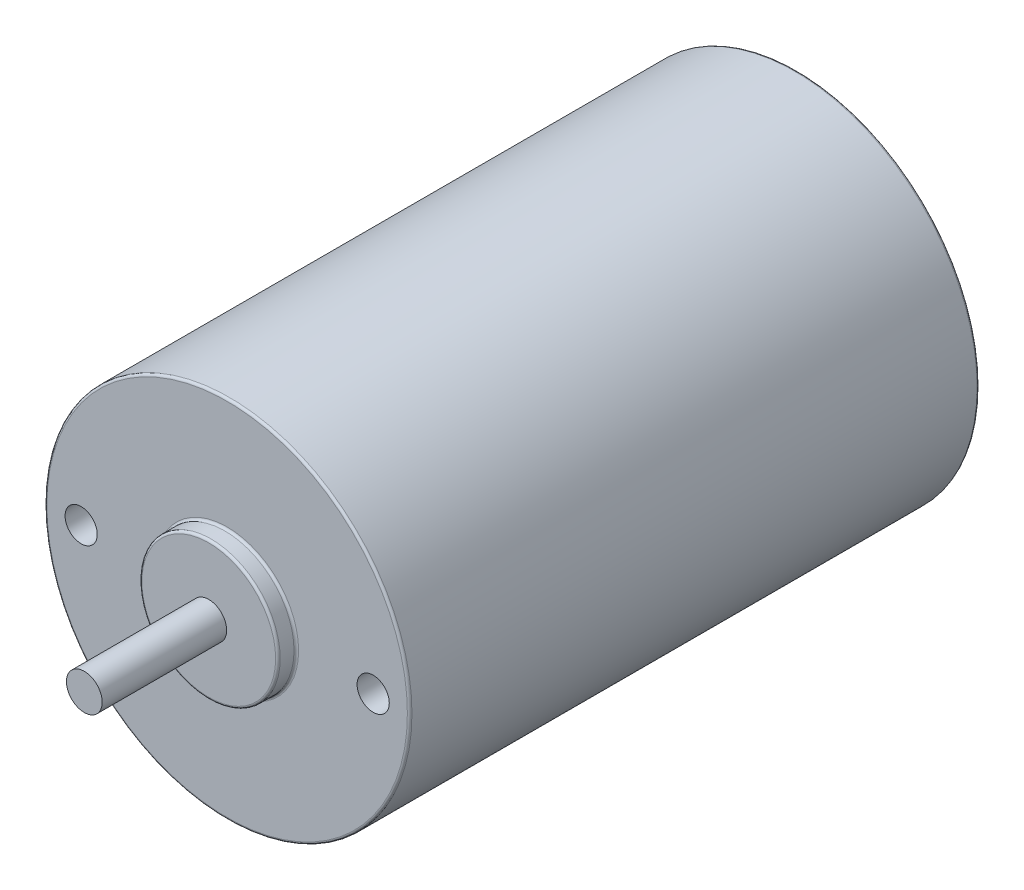
ISO-10303-21;
HEADER;
FILE_DESCRIPTION(('STEP AP214'),'2;1');
FILE_NAME('part.step','',(''),(''),'','','');
FILE_SCHEMA(('AUTOMOTIVE_DESIGN { 1 0 10303 214 1 1 1 1 }'));
ENDSEC;
DATA;
#1=APPLICATION_CONTEXT('core data for automotive mechanical design processes');
#2=APPLICATION_PROTOCOL_DEFINITION('international standard','automotive_design',2000,#1);
#3=PRODUCT_CONTEXT('',#1,'mechanical');
#4=PRODUCT('Part','Part','',(#3));
#5=PRODUCT_RELATED_PRODUCT_CATEGORY('part','',(#4));
#6=PRODUCT_DEFINITION_FORMATION('','',#4);
#7=PRODUCT_DEFINITION_CONTEXT('part definition',#1,'design');
#8=PRODUCT_DEFINITION('design','',#6,#7);
#9=PRODUCT_DEFINITION_SHAPE('','',#8);
#10=(LENGTH_UNIT() NAMED_UNIT(*) SI_UNIT(.MILLI.,.METRE.));
#11=(NAMED_UNIT(*) PLANE_ANGLE_UNIT() SI_UNIT($,.RADIAN.));
#12=(NAMED_UNIT(*) SI_UNIT($,.STERADIAN.) SOLID_ANGLE_UNIT());
#13=UNCERTAINTY_MEASURE_WITH_UNIT(LENGTH_MEASURE(1.E-05),#10,'distance_accuracy_value','');
#14=(GEOMETRIC_REPRESENTATION_CONTEXT(3) GLOBAL_UNCERTAINTY_ASSIGNED_CONTEXT((#13)) GLOBAL_UNIT_ASSIGNED_CONTEXT((#10,
#11,#12)) REPRESENTATION_CONTEXT('',''));
#15=CARTESIAN_POINT('',(0.,0.,0.));
#16=DIRECTION('',(0.,0.,1.));
#17=DIRECTION('',(1.,0.,0.));
#18=AXIS2_PLACEMENT_3D('',#15,#16,#17);
#19=CARTESIAN_POINT('',(1.55,0.,26.375));
#20=DIRECTION('',(0.,0.,1.));
#21=DIRECTION('',(1.,0.,0.));
#22=AXIS2_PLACEMENT_3D('',#19,#20,#21);
#23=PLANE('',#22);
#24=CARTESIAN_POINT('',(0.,0.,26.375));
#25=DIRECTION('',(0.,0.,1.));
#26=DIRECTION('',(1.,0.,0.));
#27=AXIS2_PLACEMENT_3D('',#24,#25,#26);
#28=CIRCLE('',#27,5.815);
#29=CARTESIAN_POINT('',(5.815,0.,26.375));
#30=VERTEX_POINT('',#29);
#31=EDGE_CURVE('E10',#30,#30,#28,.T.);
#32=ORIENTED_EDGE('',*,*,#31,.T.);
#33=EDGE_LOOP('',(#32));
#34=FACE_BOUND('',#33,.T.);
#35=CARTESIAN_POINT('',(0.,0.,26.375));
#36=DIRECTION('',(0.,0.,1.));
#37=DIRECTION('',(1.,0.,0.));
#38=AXIS2_PLACEMENT_3D('',#35,#36,#37);
#39=CIRCLE('',#38,1.555);
#40=CARTESIAN_POINT('',(1.555,0.,26.375));
#41=VERTEX_POINT('',#40);
#42=EDGE_CURVE('E77',#41,#41,#39,.F.);
#43=ORIENTED_EDGE('',*,*,#42,.T.);
#44=EDGE_LOOP('',(#43));
#45=FACE_BOUND('',#44,.T.);
#46=ADVANCED_FACE('F32',(#34,#45),#23,.T.);
#47=CARTESIAN_POINT('',(0.,0.,0.));
#48=DIRECTION('',(0.,0.,1.));
#49=DIRECTION('',(1.,0.,0.));
#50=AXIS2_PLACEMENT_3D('',#47,#48,#49);
#51=CYLINDRICAL_SURFACE('',#50,1.55);
#52=CARTESIAN_POINT('',(0.,0.,-26.375));
#53=DIRECTION('',(0.,0.,1.));
#54=DIRECTION('',(1.,0.,0.));
#55=AXIS2_PLACEMENT_3D('',#52,#53,#54);
#56=CIRCLE('',#55,1.55);
#57=CARTESIAN_POINT('',(1.55,0.,-26.375));
#58=VERTEX_POINT('',#57);
#59=EDGE_CURVE('E76',#58,#58,#56,.T.);
#60=ORIENTED_EDGE('',*,*,#59,.F.);
#61=EDGE_LOOP('',(#60));
#62=FACE_BOUND('',#61,.T.);
#63=CARTESIAN_POINT('',(0.,0.,0.));
#64=DIRECTION('',(0.,0.,1.));
#65=DIRECTION('',(1.,0.,0.));
#66=AXIS2_PLACEMENT_3D('',#63,#64,#65);
#67=CIRCLE('',#66,1.55);
#68=CARTESIAN_POINT('',(1.55,0.,0.));
#69=VERTEX_POINT('',#68);
#70=EDGE_CURVE('E80',#69,#69,#67,.T.);
#71=ORIENTED_EDGE('',*,*,#70,.T.);
#72=EDGE_LOOP('',(#71));
#73=FACE_BOUND('',#72,.T.);
#74=ADVANCED_FACE('F136',(#62,#73),#51,.F.);
#75=CARTESIAN_POINT('',(1.55,0.,-26.375));
#76=DIRECTION('',(0.,0.,-1.));
#77=DIRECTION('',(-1.,0.,0.));
#78=AXIS2_PLACEMENT_3D('',#75,#76,#77);
#79=PLANE('',#78);
#80=CARTESIAN_POINT('',(0.,0.,-26.375));
#81=DIRECTION('',(0.,0.,-1.));
#82=DIRECTION('',(-1.,0.,0.));
#83=AXIS2_PLACEMENT_3D('',#80,#81,#82);
#84=CIRCLE('',#83,5.815);
#85=CARTESIAN_POINT('',(-5.815,0.,-26.375));
#86=VERTEX_POINT('',#85);
#87=EDGE_CURVE('E55',#86,#86,#84,.T.);
#88=ORIENTED_EDGE('',*,*,#87,.T.);
#89=EDGE_LOOP('',(#88));
#90=FACE_BOUND('',#89,.T.);
#91=ORIENTED_EDGE('',*,*,#59,.T.);
#92=EDGE_LOOP('',(#91));
#93=FACE_BOUND('',#92,.T.);
#94=ADVANCED_FACE('F141',(#90,#93),#79,.T.);
#95=CARTESIAN_POINT('',(0.,0.,0.));
#96=DIRECTION('',(0.,0.,1.));
#97=DIRECTION('',(1.,0.,0.));
#98=AXIS2_PLACEMENT_3D('',#95,#96,#97);
#99=CYLINDRICAL_SURFACE('',#98,6.015);
#100=CARTESIAN_POINT('',(0.,0.,-24.975));
#101=DIRECTION('',(0.,0.,-1.));
#102=DIRECTION('',(-1.,0.,0.));
#103=AXIS2_PLACEMENT_3D('',#100,#101,#102);
#104=CIRCLE('',#103,6.015);
#105=CARTESIAN_POINT('',(-6.015,0.,-24.975));
#106=VERTEX_POINT('',#105);
#107=EDGE_CURVE('E58',#106,#106,#104,.T.);
#108=ORIENTED_EDGE('',*,*,#107,.T.);
#109=EDGE_LOOP('',(#108));
#110=FACE_BOUND('',#109,.T.);
#111=CARTESIAN_POINT('',(0.,0.,-26.175));
#112=DIRECTION('',(0.,0.,-1.));
#113=DIRECTION('',(-1.,0.,0.));
#114=AXIS2_PLACEMENT_3D('',#111,#112,#113);
#115=CIRCLE('',#114,6.015);
#116=CARTESIAN_POINT('',(-6.015,0.,-26.175));
#117=VERTEX_POINT('',#116);
#118=EDGE_CURVE('E61',#117,#117,#115,.F.);
#119=ORIENTED_EDGE('',*,*,#118,.T.);
#120=EDGE_LOOP('',(#119));
#121=FACE_BOUND('',#120,.T.);
#122=ADVANCED_FACE('F156',(#110,#121),#99,.T.);
#123=CARTESIAN_POINT('',(6.015,0.,-24.775));
#124=DIRECTION('',(0.,0.,-1.));
#125=DIRECTION('',(-1.,0.,0.));
#126=AXIS2_PLACEMENT_3D('',#123,#124,#125);
#127=PLANE('',#126);
#128=CARTESIAN_POINT('',(0.,0.,-24.775));
#129=DIRECTION('',(0.,0.,-1.));
#130=DIRECTION('',(-1.,0.,0.));
#131=AXIS2_PLACEMENT_3D('',#128,#129,#130);
#132=CIRCLE('',#131,15.675);
#133=CARTESIAN_POINT('',(-15.675,0.,-24.775));
#134=VERTEX_POINT('',#133);
#135=EDGE_CURVE('E64',#134,#134,#132,.T.);
#136=ORIENTED_EDGE('',*,*,#135,.T.);
#137=EDGE_LOOP('',(#136));
#138=FACE_BOUND('',#137,.T.);
#139=CARTESIAN_POINT('',(0.,0.,-24.775));
#140=DIRECTION('',(0.,0.,-1.));
#141=DIRECTION('',(-1.,0.,0.));
#142=AXIS2_PLACEMENT_3D('',#139,#140,#141);
#143=CIRCLE('',#142,6.215);
#144=CARTESIAN_POINT('',(-6.215,0.,-24.775));
#145=VERTEX_POINT('',#144);
#146=EDGE_CURVE('E67',#145,#145,#143,.F.);
#147=ORIENTED_EDGE('',*,*,#146,.T.);
#148=EDGE_LOOP('',(#147));
#149=FACE_BOUND('',#148,.T.);
#150=ADVANCED_FACE('F152',(#138,#149),#127,.T.);
#151=CARTESIAN_POINT('',(0.,0.,0.));
#152=DIRECTION('',(0.,0.,1.));
#153=DIRECTION('',(1.,0.,0.));
#154=AXIS2_PLACEMENT_3D('',#151,#152,#153);
#155=CYLINDRICAL_SURFACE('',#154,15.875);
#156=CARTESIAN_POINT('',(0.,0.,-24.575));
#157=DIRECTION('',(0.,0.,-1.));
#158=DIRECTION('',(-1.,0.,0.));
#159=AXIS2_PLACEMENT_3D('',#156,#157,#158);
#160=CIRCLE('',#159,15.875);
#161=CARTESIAN_POINT('',(-15.875,0.,-24.575));
#162=VERTEX_POINT('',#161);
#163=EDGE_CURVE('E70',#162,#162,#160,.F.);
#164=ORIENTED_EDGE('',*,*,#163,.T.);
#165=EDGE_LOOP('',(#164));
#166=FACE_BOUND('',#165,.T.);
#167=CARTESIAN_POINT('',(0.,0.,24.575));
#168=DIRECTION('',(0.,0.,1.));
#169=DIRECTION('',(1.,0.,0.));
#170=AXIS2_PLACEMENT_3D('',#167,#168,#169);
#171=CIRCLE('',#170,15.875);
#172=CARTESIAN_POINT('',(15.875,0.,24.575));
#173=VERTEX_POINT('',#172);
#174=EDGE_CURVE('E73',#173,#173,#171,.F.);
#175=ORIENTED_EDGE('',*,*,#174,.T.);
#176=EDGE_LOOP('',(#175));
#177=FACE_BOUND('',#176,.T.);
#178=ADVANCED_FACE('F114',(#166,#177),#155,.T.);
#179=CARTESIAN_POINT('',(6.015,0.,24.775));
#180=DIRECTION('',(0.,0.,1.));
#181=DIRECTION('',(1.,0.,0.));
#182=AXIS2_PLACEMENT_3D('',#179,#180,#181);
#183=PLANE('',#182);
#184=CARTESIAN_POINT('',(12.7,0.,24.775));
#185=DIRECTION('',(0.,0.,1.));
#186=DIRECTION('',(1.,0.,0.));
#187=AXIS2_PLACEMENT_3D('',#184,#185,#186);
#188=CIRCLE('',#187,1.4);
#189=CARTESIAN_POINT('',(14.1,0.,24.775));
#190=VERTEX_POINT('',#189);
#191=EDGE_CURVE('E95',#190,#190,#188,.T.);
#192=ORIENTED_EDGE('',*,*,#191,.F.);
#193=EDGE_LOOP('',(#192));
#194=FACE_BOUND('',#193,.T.);
#195=CARTESIAN_POINT('',(-12.7,0.,24.775));
#196=DIRECTION('',(0.,0.,1.));
#197=DIRECTION('',(1.,0.,0.));
#198=AXIS2_PLACEMENT_3D('',#195,#196,#197);
#199=CIRCLE('',#198,1.4);
#200=CARTESIAN_POINT('',(-11.3,0.,24.775));
#201=VERTEX_POINT('',#200);
#202=EDGE_CURVE('E89',#201,#201,#199,.T.);
#203=ORIENTED_EDGE('',*,*,#202,.F.);
#204=EDGE_LOOP('',(#203));
#205=FACE_BOUND('',#204,.T.);
#206=CARTESIAN_POINT('',(0.,0.,24.775));
#207=DIRECTION('',(0.,0.,1.));
#208=DIRECTION('',(1.,0.,0.));
#209=AXIS2_PLACEMENT_3D('',#206,#207,#208);
#210=CIRCLE('',#209,15.675);
#211=CARTESIAN_POINT('',(15.675,0.,24.775));
#212=VERTEX_POINT('',#211);
#213=EDGE_CURVE('E47',#212,#212,#210,.T.);
#214=ORIENTED_EDGE('',*,*,#213,.T.);
#215=EDGE_LOOP('',(#214));
#216=FACE_BOUND('',#215,.T.);
#217=CARTESIAN_POINT('',(0.,0.,24.775));
#218=DIRECTION('',(0.,0.,1.));
#219=DIRECTION('',(1.,0.,0.));
#220=AXIS2_PLACEMENT_3D('',#217,#218,#219);
#221=CIRCLE('',#220,6.215);
#222=CARTESIAN_POINT('',(6.215,0.,24.775));
#223=VERTEX_POINT('',#222);
#224=EDGE_CURVE('E52',#223,#223,#221,.F.);
#225=ORIENTED_EDGE('',*,*,#224,.T.);
#226=EDGE_LOOP('',(#225));
#227=FACE_BOUND('',#226,.T.);
#228=ADVANCED_FACE('F110',(#194,#205,#216,#227),#183,.T.);
#229=CARTESIAN_POINT('',(0.,0.,0.));
#230=DIRECTION('',(0.,0.,1.));
#231=DIRECTION('',(1.,0.,0.));
#232=AXIS2_PLACEMENT_3D('',#229,#230,#231);
#233=CYLINDRICAL_SURFACE('',#232,6.015);
#234=CARTESIAN_POINT('',(0.,0.,24.975));
#235=DIRECTION('',(0.,0.,1.));
#236=DIRECTION('',(1.,0.,0.));
#237=AXIS2_PLACEMENT_3D('',#234,#235,#236);
#238=CIRCLE('',#237,6.015);
#239=CARTESIAN_POINT('',(6.015,0.,24.975));
#240=VERTEX_POINT('',#239);
#241=EDGE_CURVE('E39',#240,#240,#238,.T.);
#242=ORIENTED_EDGE('',*,*,#241,.T.);
#243=EDGE_LOOP('',(#242));
#244=FACE_BOUND('',#243,.T.);
#245=CARTESIAN_POINT('',(0.,0.,26.175));
#246=DIRECTION('',(0.,0.,1.));
#247=DIRECTION('',(1.,0.,0.));
#248=AXIS2_PLACEMENT_3D('',#245,#246,#247);
#249=CIRCLE('',#248,6.015);
#250=CARTESIAN_POINT('',(6.015,0.,26.175));
#251=VERTEX_POINT('',#250);
#252=EDGE_CURVE('E43',#251,#251,#249,.F.);
#253=ORIENTED_EDGE('',*,*,#252,.T.);
#254=EDGE_LOOP('',(#253));
#255=FACE_BOUND('',#254,.T.);
#256=ADVANCED_FACE('F113',(#244,#255),#233,.T.);
#257=CARTESIAN_POINT('',(0.,0.,0.));
#258=DIRECTION('',(0.,0.,1.));
#259=DIRECTION('',(1.,0.,0.));
#260=AXIS2_PLACEMENT_3D('',#257,#258,#259);
#261=PLANE('',#260);
#262=ORIENTED_EDGE('',*,*,#70,.F.);
#263=EDGE_LOOP('',(#262));
#264=FACE_BOUND('',#263,.T.);
#265=ADVANCED_FACE('F148',(#264),#261,.F.);
#266=CARTESIAN_POINT('',(0.,0.,37.2));
#267=DIRECTION('',(0.,0.,-1.));
#268=DIRECTION('',(-1.,0.,0.));
#269=AXIS2_PLACEMENT_3D('',#266,#267,#268);
#270=CYLINDRICAL_SURFACE('',#269,1.555);
#271=ORIENTED_EDGE('',*,*,#42,.F.);
#272=EDGE_LOOP('',(#271));
#273=FACE_BOUND('',#272,.T.);
#274=CARTESIAN_POINT('',(0.,0.,37.2));
#275=DIRECTION('',(0.,0.,1.));
#276=DIRECTION('',(1.,0.,0.));
#277=AXIS2_PLACEMENT_3D('',#274,#275,#276);
#278=CIRCLE('',#277,1.555);
#279=CARTESIAN_POINT('',(1.555,0.,37.2));
#280=VERTEX_POINT('',#279);
#281=EDGE_CURVE('E83',#280,#280,#278,.T.);
#282=ORIENTED_EDGE('',*,*,#281,.F.);
#283=EDGE_LOOP('',(#282));
#284=FACE_BOUND('',#283,.T.);
#285=ADVANCED_FACE('F187',(#273,#284),#270,.T.);
#286=CARTESIAN_POINT('',(0.,0.,37.2));
#287=DIRECTION('',(0.,0.,1.));
#288=DIRECTION('',(1.,0.,0.));
#289=AXIS2_PLACEMENT_3D('',#286,#287,#288);
#290=PLANE('',#289);
#291=ORIENTED_EDGE('',*,*,#281,.T.);
#292=EDGE_LOOP('',(#291));
#293=FACE_BOUND('',#292,.T.);
#294=ADVANCED_FACE('F168',(#293),#290,.T.);
#295=CARTESIAN_POINT('',(0.,0.,-24.575));
#296=DIRECTION('',(0.,0.,-1.));
#297=DIRECTION('',(-1.,0.,0.));
#298=AXIS2_PLACEMENT_3D('',#295,#296,#297);
#299=TOROIDAL_SURFACE('',#298,15.675,0.2);
#300=ORIENTED_EDGE('',*,*,#135,.F.);
#301=EDGE_LOOP('',(#300));
#302=FACE_BOUND('',#301,.T.);
#303=ORIENTED_EDGE('',*,*,#163,.F.);
#304=EDGE_LOOP('',(#303));
#305=FACE_BOUND('',#304,.T.);
#306=ADVANCED_FACE('F164',(#302,#305),#299,.T.);
#307=CARTESIAN_POINT('',(0.,0.,-24.975));
#308=DIRECTION('',(0.,0.,-1.));
#309=DIRECTION('',(-1.,0.,0.));
#310=AXIS2_PLACEMENT_3D('',#307,#308,#309);
#311=TOROIDAL_SURFACE('',#310,6.215,0.2);
#312=ORIENTED_EDGE('',*,*,#107,.F.);
#313=EDGE_LOOP('',(#312));
#314=FACE_BOUND('',#313,.T.);
#315=ORIENTED_EDGE('',*,*,#146,.F.);
#316=EDGE_LOOP('',(#315));
#317=FACE_BOUND('',#316,.T.);
#318=ADVANCED_FACE('F167',(#314,#317),#311,.F.);
#319=CARTESIAN_POINT('',(0.,0.,-26.175));
#320=DIRECTION('',(0.,0.,-1.));
#321=DIRECTION('',(-1.,0.,0.));
#322=AXIS2_PLACEMENT_3D('',#319,#320,#321);
#323=TOROIDAL_SURFACE('',#322,5.815,0.2);
#324=ORIENTED_EDGE('',*,*,#87,.F.);
#325=EDGE_LOOP('',(#324));
#326=FACE_BOUND('',#325,.T.);
#327=ORIENTED_EDGE('',*,*,#118,.F.);
#328=EDGE_LOOP('',(#327));
#329=FACE_BOUND('',#328,.T.);
#330=ADVANCED_FACE('F132',(#326,#329),#323,.T.);
#331=CARTESIAN_POINT('',(0.,0.,24.575));
#332=DIRECTION('',(0.,0.,1.));
#333=DIRECTION('',(1.,0.,0.));
#334=AXIS2_PLACEMENT_3D('',#331,#332,#333);
#335=TOROIDAL_SURFACE('',#334,15.675,0.2);
#336=ORIENTED_EDGE('',*,*,#174,.F.);
#337=EDGE_LOOP('',(#336));
#338=FACE_BOUND('',#337,.T.);
#339=ORIENTED_EDGE('',*,*,#213,.F.);
#340=EDGE_LOOP('',(#339));
#341=FACE_BOUND('',#340,.T.);
#342=ADVANCED_FACE('F125',(#338,#341),#335,.T.);
#343=CARTESIAN_POINT('',(0.,0.,24.975));
#344=DIRECTION('',(0.,0.,1.));
#345=DIRECTION('',(1.,0.,0.));
#346=AXIS2_PLACEMENT_3D('',#343,#344,#345);
#347=TOROIDAL_SURFACE('',#346,6.215,0.2);
#348=ORIENTED_EDGE('',*,*,#224,.F.);
#349=EDGE_LOOP('',(#348));
#350=FACE_BOUND('',#349,.T.);
#351=ORIENTED_EDGE('',*,*,#241,.F.);
#352=EDGE_LOOP('',(#351));
#353=FACE_BOUND('',#352,.T.);
#354=ADVANCED_FACE('F122',(#350,#353),#347,.F.);
#355=CARTESIAN_POINT('',(0.,0.,26.175));
#356=DIRECTION('',(0.,0.,1.));
#357=DIRECTION('',(1.,0.,0.));
#358=AXIS2_PLACEMENT_3D('',#355,#356,#357);
#359=TOROIDAL_SURFACE('',#358,5.815,0.2);
#360=ORIENTED_EDGE('',*,*,#252,.F.);
#361=EDGE_LOOP('',(#360));
#362=FACE_BOUND('',#361,.T.);
#363=ORIENTED_EDGE('',*,*,#31,.F.);
#364=EDGE_LOOP('',(#363));
#365=FACE_BOUND('',#364,.T.);
#366=ADVANCED_FACE('F34',(#362,#365),#359,.T.);
#367=CARTESIAN_POINT('',(-12.7,0.,19.775));
#368=DIRECTION('',(0.,0.,1.));
#369=DIRECTION('',(1.,0.,0.));
#370=AXIS2_PLACEMENT_3D('',#367,#368,#369);
#371=CYLINDRICAL_SURFACE('',#370,1.4);
#372=CARTESIAN_POINT('',(-12.7,0.,19.775));
#373=DIRECTION('',(0.,0.,1.));
#374=DIRECTION('',(1.,0.,0.));
#375=AXIS2_PLACEMENT_3D('',#372,#373,#374);
#376=CIRCLE('',#375,1.4);
#377=CARTESIAN_POINT('',(-11.3,0.,19.775));
#378=VERTEX_POINT('',#377);
#379=EDGE_CURVE('E88',#378,#378,#376,.T.);
#380=ORIENTED_EDGE('',*,*,#379,.F.);
#381=EDGE_LOOP('',(#380));
#382=FACE_BOUND('',#381,.T.);
#383=ORIENTED_EDGE('',*,*,#202,.T.);
#384=EDGE_LOOP('',(#383));
#385=FACE_BOUND('',#384,.T.);
#386=ADVANCED_FACE('F130',(#382,#385),#371,.F.);
#387=CARTESIAN_POINT('',(-12.7,0.,19.775));
#388=DIRECTION('',(0.,0.,1.));
#389=DIRECTION('',(1.,0.,0.));
#390=AXIS2_PLACEMENT_3D('',#387,#388,#389);
#391=PLANE('',#390);
#392=ORIENTED_EDGE('',*,*,#379,.T.);
#393=EDGE_LOOP('',(#392));
#394=FACE_BOUND('',#393,.T.);
#395=ADVANCED_FACE('F106',(#394),#391,.T.);
#396=CARTESIAN_POINT('',(12.7,0.,19.775));
#397=DIRECTION('',(0.,0.,1.));
#398=DIRECTION('',(1.,0.,0.));
#399=AXIS2_PLACEMENT_3D('',#396,#397,#398);
#400=CYLINDRICAL_SURFACE('',#399,1.4);
#401=CARTESIAN_POINT('',(12.7,0.,19.775));
#402=DIRECTION('',(0.,0.,1.));
#403=DIRECTION('',(1.,0.,0.));
#404=AXIS2_PLACEMENT_3D('',#401,#402,#403);
#405=CIRCLE('',#404,1.4);
#406=CARTESIAN_POINT('',(14.1,0.,19.775));
#407=VERTEX_POINT('',#406);
#408=EDGE_CURVE('E92',#407,#407,#405,.T.);
#409=ORIENTED_EDGE('',*,*,#408,.F.);
#410=EDGE_LOOP('',(#409));
#411=FACE_BOUND('',#410,.T.);
#412=ORIENTED_EDGE('',*,*,#191,.T.);
#413=EDGE_LOOP('',(#412));
#414=FACE_BOUND('',#413,.T.);
#415=ADVANCED_FACE('F103',(#411,#414),#400,.F.);
#416=CARTESIAN_POINT('',(12.7,0.,19.775));
#417=DIRECTION('',(0.,0.,1.));
#418=DIRECTION('',(1.,0.,0.));
#419=AXIS2_PLACEMENT_3D('',#416,#417,#418);
#420=PLANE('',#419);
#421=ORIENTED_EDGE('',*,*,#408,.T.);
#422=EDGE_LOOP('',(#421));
#423=FACE_BOUND('',#422,.T.);
#424=ADVANCED_FACE('F101',(#423),#420,.T.);
#425=CLOSED_SHELL('',(#46,#74,#94,#122,#150,#178,#228,#256,#265,#285,#294,#306,#318,#330,#342,
#354,#366,#386,#395,#415,#424));
#426=MANIFOLD_SOLID_BREP('B2',#425);
#427=ADVANCED_BREP_SHAPE_REPRESENTATION('',(#18,#426),#14);
#428=SHAPE_DEFINITION_REPRESENTATION(#9,#427);
ENDSEC;
END-ISO-10303-21;
